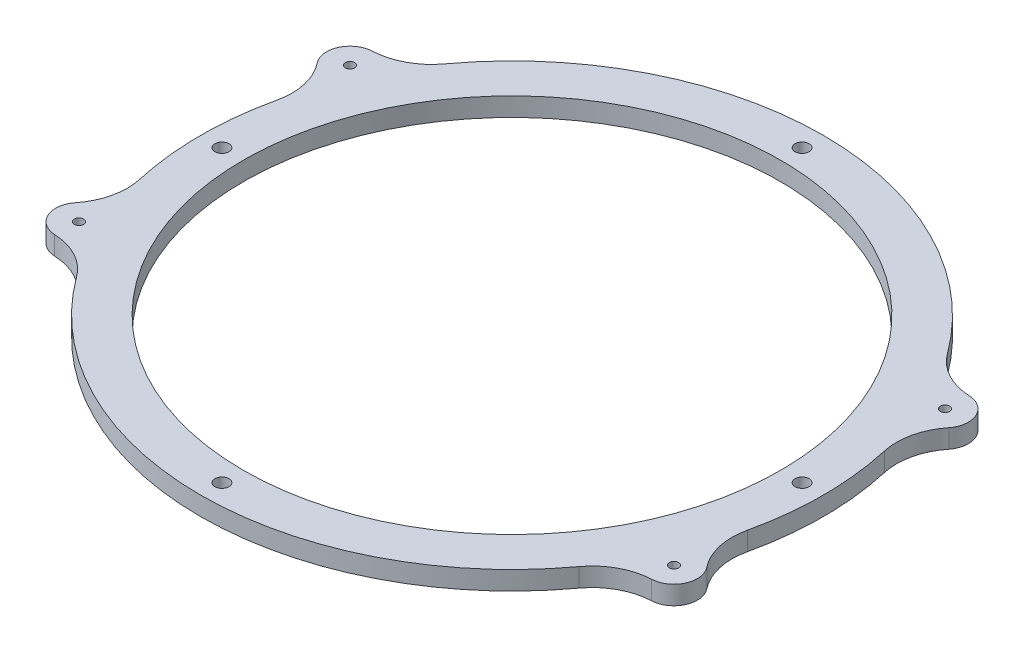
ISO-10303-21;
HEADER;
FILE_DESCRIPTION(('STEP AP214'),'2;1');
FILE_NAME('part.step','',(''),(''),'','','');
FILE_SCHEMA(('AUTOMOTIVE_DESIGN { 1 0 10303 214 1 1 1 1 }'));
ENDSEC;
DATA;
#1=APPLICATION_CONTEXT('core data for automotive mechanical design processes');
#2=APPLICATION_PROTOCOL_DEFINITION('international standard','automotive_design',2000,#1);
#3=PRODUCT_CONTEXT('',#1,'mechanical');
#4=PRODUCT('Part','Part','',(#3));
#5=PRODUCT_RELATED_PRODUCT_CATEGORY('part','',(#4));
#6=PRODUCT_DEFINITION_FORMATION('','',#4);
#7=PRODUCT_DEFINITION_CONTEXT('part definition',#1,'design');
#8=PRODUCT_DEFINITION('design','',#6,#7);
#9=PRODUCT_DEFINITION_SHAPE('','',#8);
#10=(LENGTH_UNIT() NAMED_UNIT(*) SI_UNIT(.MILLI.,.METRE.));
#11=(NAMED_UNIT(*) PLANE_ANGLE_UNIT() SI_UNIT($,.RADIAN.));
#12=(NAMED_UNIT(*) SI_UNIT($,.STERADIAN.) SOLID_ANGLE_UNIT());
#13=UNCERTAINTY_MEASURE_WITH_UNIT(LENGTH_MEASURE(1.E-05),#10,'distance_accuracy_value','');
#14=(GEOMETRIC_REPRESENTATION_CONTEXT(3) GLOBAL_UNCERTAINTY_ASSIGNED_CONTEXT((#13)) GLOBAL_UNIT_ASSIGNED_CONTEXT((#10,
#11,#12)) REPRESENTATION_CONTEXT('',''));
#15=CARTESIAN_POINT('',(0.,0.,0.));
#16=DIRECTION('',(0.,0.,1.));
#17=DIRECTION('',(1.,0.,0.));
#18=AXIS2_PLACEMENT_3D('',#15,#16,#17);
#19=CARTESIAN_POINT('',(0.,6.,0.));
#20=DIRECTION('',(0.,1.,0.));
#21=DIRECTION('',(0.,0.,1.));
#22=AXIS2_PLACEMENT_3D('',#19,#20,#21);
#23=PLANE('',#22);
#24=CARTESIAN_POINT('',(0.,6.,-93.125));
#25=DIRECTION('',(0.,1.,0.));
#26=DIRECTION('',(0.,0.,1.));
#27=AXIS2_PLACEMENT_3D('',#24,#25,#26);
#28=CIRCLE('',#27,2.25);
#29=CARTESIAN_POINT('',(0.,6.,-90.875));
#30=VERTEX_POINT('',#29);
#31=EDGE_CURVE('E288',#30,#30,#28,.T.);
#32=ORIENTED_EDGE('',*,*,#31,.F.);
#33=EDGE_LOOP('',(#32));
#34=FACE_BOUND('',#33,.T.);
#35=CARTESIAN_POINT('',(93.1250000000018,6.,-1.79844989364883E-12));
#36=DIRECTION('',(0.,1.,0.));
#37=DIRECTION('',(0.,0.,1.));
#38=AXIS2_PLACEMENT_3D('',#35,#36,#37);
#39=CIRCLE('',#38,2.25);
#40=CARTESIAN_POINT('',(93.1250000000018,6.,2.2499999999982));
#41=VERTEX_POINT('',#40);
#42=EDGE_CURVE('E298',#41,#41,#39,.T.);
#43=ORIENTED_EDGE('',*,*,#42,.F.);
#44=EDGE_LOOP('',(#43));
#45=FACE_BOUND('',#44,.T.);
#46=CARTESIAN_POINT('',(3.59689978729767E-12,6.,93.125));
#47=DIRECTION('',(0.,1.,0.));
#48=DIRECTION('',(0.,0.,1.));
#49=AXIS2_PLACEMENT_3D('',#46,#47,#48);
#50=CIRCLE('',#49,2.25);
#51=CARTESIAN_POINT('',(3.59689978729767E-12,6.,95.375));
#52=VERTEX_POINT('',#51);
#53=EDGE_CURVE('E304',#52,#52,#50,.T.);
#54=ORIENTED_EDGE('',*,*,#53,.F.);
#55=EDGE_LOOP('',(#54));
#56=FACE_BOUND('',#55,.T.);
#57=CARTESIAN_POINT('',(-93.1249999999982,6.,1.80985441696589E-12));
#58=DIRECTION('',(0.,1.,0.));
#59=DIRECTION('',(0.,0.,1.));
#60=AXIS2_PLACEMENT_3D('',#57,#58,#59);
#61=CIRCLE('',#60,2.25);
#62=CARTESIAN_POINT('',(-93.1249999999982,6.,2.25000000000181));
#63=VERTEX_POINT('',#62);
#64=EDGE_CURVE('E310',#63,#63,#61,.T.);
#65=ORIENTED_EDGE('',*,*,#64,.F.);
#66=EDGE_LOOP('',(#65));
#67=FACE_BOUND('',#66,.T.);
#68=CARTESIAN_POINT('',(-95.5,6.,43.5));
#69=DIRECTION('',(0.,1.,0.));
#70=DIRECTION('',(0.,0.,-1.));
#71=AXIS2_PLACEMENT_3D('',#68,#69,#70);
#72=CIRCLE('',#71,1.5);
#73=CARTESIAN_POINT('',(-95.5,6.,42.));
#74=VERTEX_POINT('',#73);
#75=EDGE_CURVE('E291',#74,#74,#72,.T.);
#76=ORIENTED_EDGE('',*,*,#75,.F.);
#77=EDGE_LOOP('',(#76));
#78=FACE_BOUND('',#77,.T.);
#79=CARTESIAN_POINT('',(95.5,6.,43.5));
#80=DIRECTION('',(0.,1.,0.));
#81=DIRECTION('',(0.,0.,1.));
#82=AXIS2_PLACEMENT_3D('',#79,#80,#81);
#83=CIRCLE('',#82,1.5);
#84=CARTESIAN_POINT('',(95.5,6.,45.));
#85=VERTEX_POINT('',#84);
#86=EDGE_CURVE('E323',#85,#85,#83,.T.);
#87=ORIENTED_EDGE('',*,*,#86,.F.);
#88=EDGE_LOOP('',(#87));
#89=FACE_BOUND('',#88,.T.);
#90=CARTESIAN_POINT('',(95.5,6.,-43.5));
#91=DIRECTION('',(0.,1.,0.));
#92=DIRECTION('',(0.,0.,-1.));
#93=AXIS2_PLACEMENT_3D('',#90,#91,#92);
#94=CIRCLE('',#93,1.5);
#95=CARTESIAN_POINT('',(95.5,6.,-45.));
#96=VERTEX_POINT('',#95);
#97=EDGE_CURVE('E317',#96,#96,#94,.T.);
#98=ORIENTED_EDGE('',*,*,#97,.F.);
#99=EDGE_LOOP('',(#98));
#100=FACE_BOUND('',#99,.T.);
#101=CARTESIAN_POINT('',(-95.5,6.,-43.5));
#102=DIRECTION('',(0.,1.,0.));
#103=DIRECTION('',(0.,0.,1.));
#104=AXIS2_PLACEMENT_3D('',#101,#102,#103);
#105=CIRCLE('',#104,1.5);
#106=CARTESIAN_POINT('',(-95.5,6.,-42.));
#107=VERTEX_POINT('',#106);
#108=EDGE_CURVE('E331',#107,#107,#105,.T.);
#109=ORIENTED_EDGE('',*,*,#108,.F.);
#110=EDGE_LOOP('',(#109));
#111=FACE_BOUND('',#110,.T.);
#112=CARTESIAN_POINT('',(0.,6.,0.));
#113=DIRECTION('',(0.,1.,0.));
#114=DIRECTION('',(0.,0.,1.));
#115=AXIS2_PLACEMENT_3D('',#112,#113,#114);
#116=CIRCLE('',#115,86.25);
#117=CARTESIAN_POINT('',(0.,6.,86.25));
#118=VERTEX_POINT('',#117);
#119=EDGE_CURVE('E175',#118,#118,#116,.T.);
#120=ORIENTED_EDGE('',*,*,#119,.F.);
#121=EDGE_LOOP('',(#120));
#122=FACE_BOUND('',#121,.T.);
#123=CARTESIAN_POINT('',(95.5,6.,-43.5));
#124=DIRECTION('',(0.,-1.,0.));
#125=DIRECTION('',(0.,0.,-1.));
#126=AXIS2_PLACEMENT_3D('',#123,#124,#125);
#127=CIRCLE('',#126,7.5);
#128=CARTESIAN_POINT('',(95.8445152154277,6.,-50.9920831059418));
#129=VERTEX_POINT('',#128);
#130=CARTESIAN_POINT('',(101.378604173696,6.,-38.8425314849157));
#131=VERTEX_POINT('',#130);
#132=EDGE_CURVE('E275',#129,#131,#127,.T.);
#133=ORIENTED_EDGE('',*,*,#132,.F.);
#134=CARTESIAN_POINT('',(96.7632224565683,6.,-70.9709713884533));
#135=DIRECTION('',(0.,1.,0.));
#136=DIRECTION('',(0.,0.,1.));
#137=AXIS2_PLACEMENT_3D('',#134,#135,#136);
#138=CIRCLE('',#137,20.);
#139=CARTESIAN_POINT('',(80.6360187138069,6.,-59.1424761570444));
#140=VERTEX_POINT('',#139);
#141=EDGE_CURVE('E160',#129,#140,#138,.F.);
#142=ORIENTED_EDGE('',*,*,#141,.T.);
#143=CARTESIAN_POINT('',(0.,6.,0.));
#144=DIRECTION('',(0.,1.,0.));
#145=DIRECTION('',(0.,0.,1.));
#146=AXIS2_PLACEMENT_3D('',#143,#144,#145);
#147=CIRCLE('',#146,100.);
#148=CARTESIAN_POINT('',(-80.636018713807,6.,-59.1424761570444));
#149=VERTEX_POINT('',#148);
#150=EDGE_CURVE('E168',#140,#149,#147,.T.);
#151=ORIENTED_EDGE('',*,*,#150,.T.);
#152=CARTESIAN_POINT('',(-96.7632224565684,6.,-70.9709713884533));
#153=DIRECTION('',(0.,1.,0.));
#154=DIRECTION('',(0.,0.,1.));
#155=AXIS2_PLACEMENT_3D('',#152,#153,#154);
#156=CIRCLE('',#155,20.);
#157=CARTESIAN_POINT('',(-95.8445152154278,6.,-50.9920831059418));
#158=VERTEX_POINT('',#157);
#159=EDGE_CURVE('E11',#149,#158,#156,.F.);
#160=ORIENTED_EDGE('',*,*,#159,.T.);
#161=CARTESIAN_POINT('',(-95.5,6.,-43.5));
#162=DIRECTION('',(0.,-1.,0.));
#163=DIRECTION('',(0.,0.,1.));
#164=AXIS2_PLACEMENT_3D('',#161,#162,#163);
#165=CIRCLE('',#164,7.5);
#166=CARTESIAN_POINT('',(-101.378604173696,6.,-38.8425314849157));
#167=VERTEX_POINT('',#166);
#168=EDGE_CURVE('E249',#167,#158,#165,.T.);
#169=ORIENTED_EDGE('',*,*,#168,.F.);
#170=CARTESIAN_POINT('',(-117.054881970219,6.,-26.4226154446909));
#171=DIRECTION('',(0.,1.,0.));
#172=DIRECTION('',(0.,0.,1.));
#173=AXIS2_PLACEMENT_3D('',#170,#171,#172);
#174=CIRCLE('',#173,20.);
#175=CARTESIAN_POINT('',(-97.5457349751828,6.,-22.0188462039091));
#176=VERTEX_POINT('',#175);
#177=EDGE_CURVE('E242',#167,#176,#174,.F.);
#178=ORIENTED_EDGE('',*,*,#177,.T.);
#179=CARTESIAN_POINT('',(0.,6.,0.));
#180=DIRECTION('',(0.,-1.,0.));
#181=DIRECTION('',(0.,0.,1.));
#182=AXIS2_PLACEMENT_3D('',#179,#180,#181);
#183=CIRCLE('',#182,100.);
#184=CARTESIAN_POINT('',(-97.5457349751828,6.,22.018846203909));
#185=VERTEX_POINT('',#184);
#186=EDGE_CURVE('E247',#185,#176,#183,.T.);
#187=ORIENTED_EDGE('',*,*,#186,.F.);
#188=CARTESIAN_POINT('',(-117.054881970219,6.,26.4226154446908));
#189=DIRECTION('',(0.,1.,0.));
#190=DIRECTION('',(0.,0.,1.));
#191=AXIS2_PLACEMENT_3D('',#188,#189,#190);
#192=CIRCLE('',#191,20.);
#193=CARTESIAN_POINT('',(-101.378604173696,6.,38.8425314849157));
#194=VERTEX_POINT('',#193);
#195=EDGE_CURVE('E238',#185,#194,#192,.F.);
#196=ORIENTED_EDGE('',*,*,#195,.T.);
#197=CARTESIAN_POINT('',(-95.5,6.,43.5));
#198=DIRECTION('',(0.,-1.,0.));
#199=DIRECTION('',(0.,0.,-1.));
#200=AXIS2_PLACEMENT_3D('',#197,#198,#199);
#201=CIRCLE('',#200,7.5);
#202=CARTESIAN_POINT('',(-95.8445152154278,6.,50.9920831059418));
#203=VERTEX_POINT('',#202);
#204=EDGE_CURVE('E257',#203,#194,#201,.T.);
#205=ORIENTED_EDGE('',*,*,#204,.F.);
#206=CARTESIAN_POINT('',(-96.7632224565684,6.,70.9709713884534));
#207=DIRECTION('',(0.,1.,0.));
#208=DIRECTION('',(0.,0.,1.));
#209=AXIS2_PLACEMENT_3D('',#206,#207,#208);
#210=CIRCLE('',#209,20.);
#211=CARTESIAN_POINT('',(-80.636018713807,6.,59.1424761570445));
#212=VERTEX_POINT('',#211);
#213=EDGE_CURVE('E234',#203,#212,#210,.F.);
#214=ORIENTED_EDGE('',*,*,#213,.T.);
#215=CARTESIAN_POINT('',(0.,6.,0.));
#216=DIRECTION('',(0.,1.,0.));
#217=DIRECTION('',(0.,0.,1.));
#218=AXIS2_PLACEMENT_3D('',#215,#216,#217);
#219=CIRCLE('',#218,100.);
#220=CARTESIAN_POINT('',(80.636018713807,6.,59.1424761570444));
#221=VERTEX_POINT('',#220);
#222=EDGE_CURVE('E183',#212,#221,#219,.T.);
#223=ORIENTED_EDGE('',*,*,#222,.T.);
#224=CARTESIAN_POINT('',(96.7632224565684,6.,70.9709713884533));
#225=DIRECTION('',(0.,1.,0.));
#226=DIRECTION('',(0.,0.,1.));
#227=AXIS2_PLACEMENT_3D('',#224,#225,#226);
#228=CIRCLE('',#227,20.);
#229=CARTESIAN_POINT('',(95.8445152154277,6.,50.9920831059418));
#230=VERTEX_POINT('',#229);
#231=EDGE_CURVE('E230',#221,#230,#228,.F.);
#232=ORIENTED_EDGE('',*,*,#231,.T.);
#233=CARTESIAN_POINT('',(95.5,6.,43.5));
#234=DIRECTION('',(0.,-1.,0.));
#235=DIRECTION('',(0.,0.,1.));
#236=AXIS2_PLACEMENT_3D('',#233,#234,#235);
#237=CIRCLE('',#236,7.5);
#238=CARTESIAN_POINT('',(101.378604173696,6.,38.8425314849157));
#239=VERTEX_POINT('',#238);
#240=EDGE_CURVE('E280',#239,#230,#237,.T.);
#241=ORIENTED_EDGE('',*,*,#240,.F.);
#242=CARTESIAN_POINT('',(117.054881970219,6.,26.4226154446909));
#243=DIRECTION('',(0.,1.,0.));
#244=DIRECTION('',(0.,0.,1.));
#245=AXIS2_PLACEMENT_3D('',#242,#243,#244);
#246=CIRCLE('',#245,20.);
#247=CARTESIAN_POINT('',(97.5457349751828,6.,22.0188462039091));
#248=VERTEX_POINT('',#247);
#249=EDGE_CURVE('E226',#239,#248,#246,.F.);
#250=ORIENTED_EDGE('',*,*,#249,.T.);
#251=CARTESIAN_POINT('',(0.,6.,0.));
#252=DIRECTION('',(0.,-1.,0.));
#253=DIRECTION('',(0.,0.,-1.));
#254=AXIS2_PLACEMENT_3D('',#251,#252,#253);
#255=CIRCLE('',#254,100.);
#256=CARTESIAN_POINT('',(97.5457349751828,6.,-22.018846203909));
#257=VERTEX_POINT('',#256);
#258=EDGE_CURVE('E283',#257,#248,#255,.T.);
#259=ORIENTED_EDGE('',*,*,#258,.F.);
#260=CARTESIAN_POINT('',(117.054881970219,6.,-26.4226154446908));
#261=DIRECTION('',(0.,1.,0.));
#262=DIRECTION('',(0.,0.,1.));
#263=AXIS2_PLACEMENT_3D('',#260,#261,#262);
#264=CIRCLE('',#263,20.);
#265=EDGE_CURVE('E222',#257,#131,#264,.F.);
#266=ORIENTED_EDGE('',*,*,#265,.T.);
#267=EDGE_LOOP('',(#133,#142,#151,#160,#169,#178,#187,#196,#205,#214,#223,#232,#241,#250,#259,#266));
#268=FACE_BOUND('',#267,.T.);
#269=ADVANCED_FACE('F37',(#34,#45,#56,#67,#78,#89,#100,#111,#122,#268),#23,.T.);
#270=CARTESIAN_POINT('',(0.,0.,0.));
#271=DIRECTION('',(0.,1.,0.));
#272=DIRECTION('',(0.,0.,1.));
#273=AXIS2_PLACEMENT_3D('',#270,#271,#272);
#274=PLANE('',#273);
#275=CARTESIAN_POINT('',(0.,0.,-93.125));
#276=DIRECTION('',(0.,1.,0.));
#277=DIRECTION('',(0.,0.,1.));
#278=AXIS2_PLACEMENT_3D('',#275,#276,#277);
#279=CIRCLE('',#278,2.25);
#280=CARTESIAN_POINT('',(0.,0.,-90.875));
#281=VERTEX_POINT('',#280);
#282=EDGE_CURVE('E292',#281,#281,#279,.T.);
#283=ORIENTED_EDGE('',*,*,#282,.T.);
#284=EDGE_LOOP('',(#283));
#285=FACE_BOUND('',#284,.T.);
#286=CARTESIAN_POINT('',(93.1250000000018,0.,-1.79844989364883E-12));
#287=DIRECTION('',(0.,1.,0.));
#288=DIRECTION('',(0.,0.,1.));
#289=AXIS2_PLACEMENT_3D('',#286,#287,#288);
#290=CIRCLE('',#289,2.25);
#291=CARTESIAN_POINT('',(93.1250000000018,0.,2.2499999999982));
#292=VERTEX_POINT('',#291);
#293=EDGE_CURVE('E295',#292,#292,#290,.T.);
#294=ORIENTED_EDGE('',*,*,#293,.T.);
#295=EDGE_LOOP('',(#294));
#296=FACE_BOUND('',#295,.T.);
#297=CARTESIAN_POINT('',(3.59689978729767E-12,0.,93.125));
#298=DIRECTION('',(0.,1.,0.));
#299=DIRECTION('',(0.,0.,1.));
#300=AXIS2_PLACEMENT_3D('',#297,#298,#299);
#301=CIRCLE('',#300,2.25);
#302=CARTESIAN_POINT('',(3.59689978729767E-12,0.,95.375));
#303=VERTEX_POINT('',#302);
#304=EDGE_CURVE('E301',#303,#303,#301,.T.);
#305=ORIENTED_EDGE('',*,*,#304,.T.);
#306=EDGE_LOOP('',(#305));
#307=FACE_BOUND('',#306,.T.);
#308=CARTESIAN_POINT('',(-93.1249999999982,0.,1.80985441696589E-12));
#309=DIRECTION('',(0.,1.,0.));
#310=DIRECTION('',(0.,0.,1.));
#311=AXIS2_PLACEMENT_3D('',#308,#309,#310);
#312=CIRCLE('',#311,2.25);
#313=CARTESIAN_POINT('',(-93.1249999999982,0.,2.25000000000181));
#314=VERTEX_POINT('',#313);
#315=EDGE_CURVE('E307',#314,#314,#312,.T.);
#316=ORIENTED_EDGE('',*,*,#315,.T.);
#317=EDGE_LOOP('',(#316));
#318=FACE_BOUND('',#317,.T.);
#319=CARTESIAN_POINT('',(-95.5,0.,43.5));
#320=DIRECTION('',(0.,1.,0.));
#321=DIRECTION('',(0.,0.,-1.));
#322=AXIS2_PLACEMENT_3D('',#319,#320,#321);
#323=CIRCLE('',#322,1.5);
#324=CARTESIAN_POINT('',(-95.5,0.,42.));
#325=VERTEX_POINT('',#324);
#326=EDGE_CURVE('E326',#325,#325,#323,.T.);
#327=ORIENTED_EDGE('',*,*,#326,.T.);
#328=EDGE_LOOP('',(#327));
#329=FACE_BOUND('',#328,.T.);
#330=CARTESIAN_POINT('',(95.5,0.,43.5));
#331=DIRECTION('',(0.,1.,0.));
#332=DIRECTION('',(0.,0.,1.));
#333=AXIS2_PLACEMENT_3D('',#330,#331,#332);
#334=CIRCLE('',#333,1.5);
#335=CARTESIAN_POINT('',(95.5,0.,45.));
#336=VERTEX_POINT('',#335);
#337=EDGE_CURVE('E320',#336,#336,#334,.T.);
#338=ORIENTED_EDGE('',*,*,#337,.T.);
#339=EDGE_LOOP('',(#338));
#340=FACE_BOUND('',#339,.T.);
#341=CARTESIAN_POINT('',(95.5,0.,-43.5));
#342=DIRECTION('',(0.,1.,0.));
#343=DIRECTION('',(0.,0.,-1.));
#344=AXIS2_PLACEMENT_3D('',#341,#342,#343);
#345=CIRCLE('',#344,1.5);
#346=CARTESIAN_POINT('',(95.5,0.,-45.));
#347=VERTEX_POINT('',#346);
#348=EDGE_CURVE('E313',#347,#347,#345,.T.);
#349=ORIENTED_EDGE('',*,*,#348,.T.);
#350=EDGE_LOOP('',(#349));
#351=FACE_BOUND('',#350,.T.);
#352=CARTESIAN_POINT('',(-95.5,0.,-43.5));
#353=DIRECTION('',(0.,1.,0.));
#354=DIRECTION('',(0.,0.,1.));
#355=AXIS2_PLACEMENT_3D('',#352,#353,#354);
#356=CIRCLE('',#355,1.5);
#357=CARTESIAN_POINT('',(-95.5,0.,-42.));
#358=VERTEX_POINT('',#357);
#359=EDGE_CURVE('E316',#358,#358,#356,.T.);
#360=ORIENTED_EDGE('',*,*,#359,.T.);
#361=EDGE_LOOP('',(#360));
#362=FACE_BOUND('',#361,.T.);
#363=CARTESIAN_POINT('',(0.,0.,0.));
#364=DIRECTION('',(0.,1.,0.));
#365=DIRECTION('',(0.,0.,1.));
#366=AXIS2_PLACEMENT_3D('',#363,#364,#365);
#367=CIRCLE('',#366,86.25);
#368=CARTESIAN_POINT('',(0.,0.,86.25));
#369=VERTEX_POINT('',#368);
#370=EDGE_CURVE('E180',#369,#369,#367,.T.);
#371=ORIENTED_EDGE('',*,*,#370,.T.);
#372=EDGE_LOOP('',(#371));
#373=FACE_BOUND('',#372,.T.);
#374=CARTESIAN_POINT('',(-95.5,0.,-43.5));
#375=DIRECTION('',(0.,-1.,0.));
#376=DIRECTION('',(0.,0.,1.));
#377=AXIS2_PLACEMENT_3D('',#374,#375,#376);
#378=CIRCLE('',#377,7.5);
#379=CARTESIAN_POINT('',(-101.378604173696,0.,-38.8425314849157));
#380=VERTEX_POINT('',#379);
#381=CARTESIAN_POINT('',(-95.8445152154278,0.,-50.9920831059418));
#382=VERTEX_POINT('',#381);
#383=EDGE_CURVE('E260',#380,#382,#378,.T.);
#384=ORIENTED_EDGE('',*,*,#383,.T.);
#385=CARTESIAN_POINT('',(-96.7632224565684,0.,-70.9709713884533));
#386=DIRECTION('',(0.,1.,0.));
#387=DIRECTION('',(0.,0.,1.));
#388=AXIS2_PLACEMENT_3D('',#385,#386,#387);
#389=CIRCLE('',#388,20.);
#390=CARTESIAN_POINT('',(-80.636018713807,0.,-59.1424761570444));
#391=VERTEX_POINT('',#390);
#392=EDGE_CURVE('E45',#382,#391,#389,.T.);
#393=ORIENTED_EDGE('',*,*,#392,.T.);
#394=CARTESIAN_POINT('',(0.,0.,0.));
#395=DIRECTION('',(0.,1.,0.));
#396=DIRECTION('',(0.,0.,1.));
#397=AXIS2_PLACEMENT_3D('',#394,#395,#396);
#398=CIRCLE('',#397,100.);
#399=CARTESIAN_POINT('',(80.6360187138069,0.,-59.1424761570444));
#400=VERTEX_POINT('',#399);
#401=EDGE_CURVE('E166',#400,#391,#398,.T.);
#402=ORIENTED_EDGE('',*,*,#401,.F.);
#403=CARTESIAN_POINT('',(96.7632224565683,0.,-70.9709713884533));
#404=DIRECTION('',(0.,1.,0.));
#405=DIRECTION('',(0.,0.,1.));
#406=AXIS2_PLACEMENT_3D('',#403,#404,#405);
#407=CIRCLE('',#406,20.);
#408=CARTESIAN_POINT('',(95.8445152154277,0.,-50.9920831059418));
#409=VERTEX_POINT('',#408);
#410=EDGE_CURVE('E150',#400,#409,#407,.T.);
#411=ORIENTED_EDGE('',*,*,#410,.T.);
#412=CARTESIAN_POINT('',(95.5,0.,-43.5));
#413=DIRECTION('',(0.,-1.,0.));
#414=DIRECTION('',(0.,0.,-1.));
#415=AXIS2_PLACEMENT_3D('',#412,#413,#414);
#416=CIRCLE('',#415,7.5);
#417=CARTESIAN_POINT('',(101.378604173696,0.,-38.8425314849157));
#418=VERTEX_POINT('',#417);
#419=EDGE_CURVE('E278',#409,#418,#416,.T.);
#420=ORIENTED_EDGE('',*,*,#419,.T.);
#421=CARTESIAN_POINT('',(117.054881970219,0.,-26.4226154446908));
#422=DIRECTION('',(0.,1.,0.));
#423=DIRECTION('',(0.,0.,1.));
#424=AXIS2_PLACEMENT_3D('',#421,#422,#423);
#425=CIRCLE('',#424,20.);
#426=CARTESIAN_POINT('',(97.5457349751828,0.,-22.018846203909));
#427=VERTEX_POINT('',#426);
#428=EDGE_CURVE('E220',#418,#427,#425,.T.);
#429=ORIENTED_EDGE('',*,*,#428,.T.);
#430=CARTESIAN_POINT('',(0.,0.,0.));
#431=DIRECTION('',(0.,-1.,0.));
#432=DIRECTION('',(0.,0.,-1.));
#433=AXIS2_PLACEMENT_3D('',#430,#431,#432);
#434=CIRCLE('',#433,100.);
#435=CARTESIAN_POINT('',(97.5457349751828,0.,22.0188462039091));
#436=VERTEX_POINT('',#435);
#437=EDGE_CURVE('E274',#427,#436,#434,.T.);
#438=ORIENTED_EDGE('',*,*,#437,.T.);
#439=CARTESIAN_POINT('',(117.054881970219,0.,26.4226154446909));
#440=DIRECTION('',(0.,1.,0.));
#441=DIRECTION('',(0.,0.,1.));
#442=AXIS2_PLACEMENT_3D('',#439,#440,#441);
#443=CIRCLE('',#442,20.);
#444=CARTESIAN_POINT('',(101.378604173696,0.,38.8425314849157));
#445=VERTEX_POINT('',#444);
#446=EDGE_CURVE('E224',#436,#445,#443,.T.);
#447=ORIENTED_EDGE('',*,*,#446,.T.);
#448=CARTESIAN_POINT('',(95.5,0.,43.5));
#449=DIRECTION('',(0.,-1.,0.));
#450=DIRECTION('',(0.,0.,1.));
#451=AXIS2_PLACEMENT_3D('',#448,#449,#450);
#452=CIRCLE('',#451,7.5);
#453=CARTESIAN_POINT('',(95.8445152154277,0.,50.9920831059418));
#454=VERTEX_POINT('',#453);
#455=EDGE_CURVE('E271',#445,#454,#452,.T.);
#456=ORIENTED_EDGE('',*,*,#455,.T.);
#457=CARTESIAN_POINT('',(96.7632224565684,0.,70.9709713884533));
#458=DIRECTION('',(0.,1.,0.));
#459=DIRECTION('',(0.,0.,1.));
#460=AXIS2_PLACEMENT_3D('',#457,#458,#459);
#461=CIRCLE('',#460,20.);
#462=CARTESIAN_POINT('',(80.636018713807,0.,59.1424761570444));
#463=VERTEX_POINT('',#462);
#464=EDGE_CURVE('E228',#454,#463,#461,.T.);
#465=ORIENTED_EDGE('',*,*,#464,.T.);
#466=CARTESIAN_POINT('',(0.,0.,0.));
#467=DIRECTION('',(0.,1.,0.));
#468=DIRECTION('',(0.,0.,1.));
#469=AXIS2_PLACEMENT_3D('',#466,#467,#468);
#470=CIRCLE('',#469,100.);
#471=CARTESIAN_POINT('',(-80.636018713807,0.,59.1424761570445));
#472=VERTEX_POINT('',#471);
#473=EDGE_CURVE('E174',#472,#463,#470,.T.);
#474=ORIENTED_EDGE('',*,*,#473,.F.);
#475=CARTESIAN_POINT('',(-96.7632224565684,0.,70.9709713884534));
#476=DIRECTION('',(0.,1.,0.));
#477=DIRECTION('',(0.,0.,1.));
#478=AXIS2_PLACEMENT_3D('',#475,#476,#477);
#479=CIRCLE('',#478,20.);
#480=CARTESIAN_POINT('',(-95.8445152154278,0.,50.9920831059418));
#481=VERTEX_POINT('',#480);
#482=EDGE_CURVE('E232',#472,#481,#479,.T.);
#483=ORIENTED_EDGE('',*,*,#482,.T.);
#484=CARTESIAN_POINT('',(-95.5,0.,43.5));
#485=DIRECTION('',(0.,-1.,0.));
#486=DIRECTION('',(0.,0.,-1.));
#487=AXIS2_PLACEMENT_3D('',#484,#485,#486);
#488=CIRCLE('',#487,7.5);
#489=CARTESIAN_POINT('',(-101.378604173696,0.,38.8425314849157));
#490=VERTEX_POINT('',#489);
#491=EDGE_CURVE('E267',#481,#490,#488,.T.);
#492=ORIENTED_EDGE('',*,*,#491,.T.);
#493=CARTESIAN_POINT('',(-117.054881970219,0.,26.4226154446908));
#494=DIRECTION('',(0.,1.,0.));
#495=DIRECTION('',(0.,0.,1.));
#496=AXIS2_PLACEMENT_3D('',#493,#494,#495);
#497=CIRCLE('',#496,20.);
#498=CARTESIAN_POINT('',(-97.5457349751828,0.,22.018846203909));
#499=VERTEX_POINT('',#498);
#500=EDGE_CURVE('E236',#490,#499,#497,.T.);
#501=ORIENTED_EDGE('',*,*,#500,.T.);
#502=CARTESIAN_POINT('',(0.,0.,0.));
#503=DIRECTION('',(0.,-1.,0.));
#504=DIRECTION('',(0.,0.,1.));
#505=AXIS2_PLACEMENT_3D('',#502,#503,#504);
#506=CIRCLE('',#505,100.);
#507=CARTESIAN_POINT('',(-97.5457349751828,0.,-22.0188462039091));
#508=VERTEX_POINT('',#507);
#509=EDGE_CURVE('E261',#499,#508,#506,.T.);
#510=ORIENTED_EDGE('',*,*,#509,.T.);
#511=CARTESIAN_POINT('',(-117.054881970219,0.,-26.4226154446909));
#512=DIRECTION('',(0.,1.,0.));
#513=DIRECTION('',(0.,0.,1.));
#514=AXIS2_PLACEMENT_3D('',#511,#512,#513);
#515=CIRCLE('',#514,20.);
#516=EDGE_CURVE('E240',#508,#380,#515,.T.);
#517=ORIENTED_EDGE('',*,*,#516,.T.);
#518=EDGE_LOOP('',(#384,#393,#402,#411,#420,#429,#438,#447,#456,#465,#474,#483,#492,#501,#510,#517));
#519=FACE_BOUND('',#518,.T.);
#520=ADVANCED_FACE('F173',(#285,#296,#307,#318,#329,#340,#351,#362,#373,#519),#274,.F.);
#521=CARTESIAN_POINT('',(0.,6.,0.));
#522=DIRECTION('',(0.,-1.,0.));
#523=DIRECTION('',(0.,0.,-1.));
#524=AXIS2_PLACEMENT_3D('',#521,#522,#523);
#525=CYLINDRICAL_SURFACE('',#524,100.);
#526=ORIENTED_EDGE('',*,*,#150,.F.);
#527=DIRECTION('',(0.,-1.,0.));
#528=VECTOR('',#527,1.);
#529=CARTESIAN_POINT('',(80.6360187138069,6.,-59.1424761570444));
#530=LINE('',#529,#528);
#531=EDGE_CURVE('E154',#140,#400,#530,.T.);
#532=ORIENTED_EDGE('',*,*,#531,.T.);
#533=ORIENTED_EDGE('',*,*,#401,.T.);
#534=DIRECTION('',(0.,-1.,0.));
#535=VECTOR('',#534,1.);
#536=CARTESIAN_POINT('',(-80.636018713807,6.,-59.1424761570444));
#537=LINE('',#536,#535);
#538=EDGE_CURVE('E170',#391,#149,#537,.F.);
#539=ORIENTED_EDGE('',*,*,#538,.T.);
#540=EDGE_LOOP('',(#526,#532,#533,#539));
#541=FACE_BOUND('',#540,.T.);
#542=ADVANCED_FACE('F165',(#541),#525,.T.);
#543=CARTESIAN_POINT('',(0.,6.,0.));
#544=DIRECTION('',(0.,-1.,0.));
#545=DIRECTION('',(0.,0.,-1.));
#546=AXIS2_PLACEMENT_3D('',#543,#544,#545);
#547=CYLINDRICAL_SURFACE('',#546,100.);
#548=ORIENTED_EDGE('',*,*,#473,.T.);
#549=DIRECTION('',(0.,-1.,0.));
#550=VECTOR('',#549,1.);
#551=CARTESIAN_POINT('',(80.6360187138069,6.,59.1424761570444));
#552=LINE('',#551,#550);
#553=EDGE_CURVE('E203',#463,#221,#552,.F.);
#554=ORIENTED_EDGE('',*,*,#553,.T.);
#555=ORIENTED_EDGE('',*,*,#222,.F.);
#556=DIRECTION('',(0.,-1.,0.));
#557=VECTOR('',#556,1.);
#558=CARTESIAN_POINT('',(-80.636018713807,6.,59.1424761570445));
#559=LINE('',#558,#557);
#560=EDGE_CURVE('E200',#212,#472,#559,.T.);
#561=ORIENTED_EDGE('',*,*,#560,.T.);
#562=EDGE_LOOP('',(#548,#554,#555,#561));
#563=FACE_BOUND('',#562,.T.);
#564=ADVANCED_FACE('F395',(#563),#547,.T.);
#565=CARTESIAN_POINT('',(0.,6.,0.));
#566=DIRECTION('',(0.,-1.,0.));
#567=DIRECTION('',(0.,0.,-1.));
#568=AXIS2_PLACEMENT_3D('',#565,#566,#567);
#569=CYLINDRICAL_SURFACE('',#568,86.25);
#570=ORIENTED_EDGE('',*,*,#119,.T.);
#571=EDGE_LOOP('',(#570));
#572=FACE_BOUND('',#571,.T.);
#573=ORIENTED_EDGE('',*,*,#370,.F.);
#574=EDGE_LOOP('',(#573));
#575=FACE_BOUND('',#574,.T.);
#576=ADVANCED_FACE('F392',(#572,#575),#569,.F.);
#577=CARTESIAN_POINT('',(-95.5,6.,-43.5));
#578=DIRECTION('',(0.,-1.,0.));
#579=DIRECTION('',(0.,0.,-1.));
#580=AXIS2_PLACEMENT_3D('',#577,#578,#579);
#581=CYLINDRICAL_SURFACE('',#580,1.5);
#582=ORIENTED_EDGE('',*,*,#108,.T.);
#583=EDGE_LOOP('',(#582));
#584=FACE_BOUND('',#583,.T.);
#585=ORIENTED_EDGE('',*,*,#359,.F.);
#586=EDGE_LOOP('',(#585));
#587=FACE_BOUND('',#586,.T.);
#588=ADVANCED_FACE('F617',(#584,#587),#581,.F.);
#589=CARTESIAN_POINT('',(95.5,6.,-43.5));
#590=DIRECTION('',(0.,-1.,0.));
#591=DIRECTION('',(0.,0.,-1.));
#592=AXIS2_PLACEMENT_3D('',#589,#590,#591);
#593=CYLINDRICAL_SURFACE('',#592,1.5);
#594=ORIENTED_EDGE('',*,*,#97,.T.);
#595=EDGE_LOOP('',(#594));
#596=FACE_BOUND('',#595,.T.);
#597=ORIENTED_EDGE('',*,*,#348,.F.);
#598=EDGE_LOOP('',(#597));
#599=FACE_BOUND('',#598,.T.);
#600=ADVANCED_FACE('F606',(#596,#599),#593,.F.);
#601=CARTESIAN_POINT('',(95.5,6.,43.5));
#602=DIRECTION('',(0.,-1.,0.));
#603=DIRECTION('',(0.,0.,-1.));
#604=AXIS2_PLACEMENT_3D('',#601,#602,#603);
#605=CYLINDRICAL_SURFACE('',#604,1.5);
#606=ORIENTED_EDGE('',*,*,#86,.T.);
#607=EDGE_LOOP('',(#606));
#608=FACE_BOUND('',#607,.T.);
#609=ORIENTED_EDGE('',*,*,#337,.F.);
#610=EDGE_LOOP('',(#609));
#611=FACE_BOUND('',#610,.T.);
#612=ADVANCED_FACE('F595',(#608,#611),#605,.F.);
#613=CARTESIAN_POINT('',(-95.5,6.,43.5));
#614=DIRECTION('',(0.,-1.,0.));
#615=DIRECTION('',(0.,0.,-1.));
#616=AXIS2_PLACEMENT_3D('',#613,#614,#615);
#617=CYLINDRICAL_SURFACE('',#616,1.5);
#618=ORIENTED_EDGE('',*,*,#75,.T.);
#619=EDGE_LOOP('',(#618));
#620=FACE_BOUND('',#619,.T.);
#621=ORIENTED_EDGE('',*,*,#326,.F.);
#622=EDGE_LOOP('',(#621));
#623=FACE_BOUND('',#622,.T.);
#624=ADVANCED_FACE('F584',(#620,#623),#617,.F.);
#625=CARTESIAN_POINT('',(-93.1249999999982,6.,1.80985441696589E-12));
#626=DIRECTION('',(0.,-1.,0.));
#627=DIRECTION('',(0.,0.,-1.));
#628=AXIS2_PLACEMENT_3D('',#625,#626,#627);
#629=CYLINDRICAL_SURFACE('',#628,2.25);
#630=ORIENTED_EDGE('',*,*,#64,.T.);
#631=EDGE_LOOP('',(#630));
#632=FACE_BOUND('',#631,.T.);
#633=ORIENTED_EDGE('',*,*,#315,.F.);
#634=EDGE_LOOP('',(#633));
#635=FACE_BOUND('',#634,.T.);
#636=ADVANCED_FACE('F573',(#632,#635),#629,.F.);
#637=CARTESIAN_POINT('',(3.59689978729767E-12,6.,93.125));
#638=DIRECTION('',(0.,-1.,0.));
#639=DIRECTION('',(0.,0.,-1.));
#640=AXIS2_PLACEMENT_3D('',#637,#638,#639);
#641=CYLINDRICAL_SURFACE('',#640,2.25);
#642=ORIENTED_EDGE('',*,*,#53,.T.);
#643=EDGE_LOOP('',(#642));
#644=FACE_BOUND('',#643,.T.);
#645=ORIENTED_EDGE('',*,*,#304,.F.);
#646=EDGE_LOOP('',(#645));
#647=FACE_BOUND('',#646,.T.);
#648=ADVANCED_FACE('F562',(#644,#647),#641,.F.);
#649=CARTESIAN_POINT('',(93.1250000000018,6.,-1.79844989364883E-12));
#650=DIRECTION('',(0.,-1.,0.));
#651=DIRECTION('',(0.,0.,-1.));
#652=AXIS2_PLACEMENT_3D('',#649,#650,#651);
#653=CYLINDRICAL_SURFACE('',#652,2.25);
#654=ORIENTED_EDGE('',*,*,#42,.T.);
#655=EDGE_LOOP('',(#654));
#656=FACE_BOUND('',#655,.T.);
#657=ORIENTED_EDGE('',*,*,#293,.F.);
#658=EDGE_LOOP('',(#657));
#659=FACE_BOUND('',#658,.T.);
#660=ADVANCED_FACE('F377',(#656,#659),#653,.F.);
#661=CARTESIAN_POINT('',(0.,6.,-93.125));
#662=DIRECTION('',(0.,-1.,0.));
#663=DIRECTION('',(0.,0.,-1.));
#664=AXIS2_PLACEMENT_3D('',#661,#662,#663);
#665=CYLINDRICAL_SURFACE('',#664,2.25);
#666=ORIENTED_EDGE('',*,*,#31,.T.);
#667=EDGE_LOOP('',(#666));
#668=FACE_BOUND('',#667,.T.);
#669=ORIENTED_EDGE('',*,*,#282,.F.);
#670=EDGE_LOOP('',(#669));
#671=FACE_BOUND('',#670,.T.);
#672=ADVANCED_FACE('F370',(#668,#671),#665,.F.);
#673=CARTESIAN_POINT('',(95.5,6.,-43.5));
#674=DIRECTION('',(0.,-1.,0.));
#675=DIRECTION('',(0.,0.,-1.));
#676=AXIS2_PLACEMENT_3D('',#673,#674,#675);
#677=CYLINDRICAL_SURFACE('',#676,7.5);
#678=ORIENTED_EDGE('',*,*,#419,.F.);
#679=DIRECTION('',(0.,-1.,0.));
#680=VECTOR('',#679,1.);
#681=CARTESIAN_POINT('',(95.8445152154277,6.,-50.9920831059418));
#682=LINE('',#681,#680);
#683=EDGE_CURVE('E155',#409,#129,#682,.F.);
#684=ORIENTED_EDGE('',*,*,#683,.T.);
#685=ORIENTED_EDGE('',*,*,#132,.T.);
#686=DIRECTION('',(0.,-1.,0.));
#687=VECTOR('',#686,1.);
#688=CARTESIAN_POINT('',(101.378604173696,6.,-38.8425314849157));
#689=LINE('',#688,#687);
#690=EDGE_CURVE('E169',#131,#418,#689,.T.);
#691=ORIENTED_EDGE('',*,*,#690,.T.);
#692=EDGE_LOOP('',(#678,#684,#685,#691));
#693=FACE_BOUND('',#692,.T.);
#694=ADVANCED_FACE('F368',(#693),#677,.T.);
#695=CARTESIAN_POINT('',(0.,6.,0.));
#696=DIRECTION('',(0.,-1.,0.));
#697=DIRECTION('',(0.,0.,-1.));
#698=AXIS2_PLACEMENT_3D('',#695,#696,#697);
#699=CYLINDRICAL_SURFACE('',#698,100.);
#700=ORIENTED_EDGE('',*,*,#437,.F.);
#701=DIRECTION('',(0.,-1.,0.));
#702=VECTOR('',#701,1.);
#703=CARTESIAN_POINT('',(97.5457349751829,6.,-22.018846203909));
#704=LINE('',#703,#702);
#705=EDGE_CURVE('E193',#427,#257,#704,.F.);
#706=ORIENTED_EDGE('',*,*,#705,.T.);
#707=ORIENTED_EDGE('',*,*,#258,.T.);
#708=DIRECTION('',(0.,-1.,0.));
#709=VECTOR('',#708,1.);
#710=CARTESIAN_POINT('',(97.5457349751828,6.,22.0188462039091));
#711=LINE('',#710,#709);
#712=EDGE_CURVE('E190',#248,#436,#711,.T.);
#713=ORIENTED_EDGE('',*,*,#712,.T.);
#714=EDGE_LOOP('',(#700,#706,#707,#713));
#715=FACE_BOUND('',#714,.T.);
#716=ADVANCED_FACE('F360',(#715),#699,.T.);
#717=CARTESIAN_POINT('',(95.5,6.,43.5));
#718=DIRECTION('',(0.,-1.,0.));
#719=DIRECTION('',(0.,0.,-1.));
#720=AXIS2_PLACEMENT_3D('',#717,#718,#719);
#721=CYLINDRICAL_SURFACE('',#720,7.5);
#722=ORIENTED_EDGE('',*,*,#455,.F.);
#723=DIRECTION('',(0.,-1.,0.));
#724=VECTOR('',#723,1.);
#725=CARTESIAN_POINT('',(101.378604173696,6.,38.8425314849157));
#726=LINE('',#725,#724);
#727=EDGE_CURVE('E198',#445,#239,#726,.F.);
#728=ORIENTED_EDGE('',*,*,#727,.T.);
#729=ORIENTED_EDGE('',*,*,#240,.T.);
#730=DIRECTION('',(0.,-1.,0.));
#731=VECTOR('',#730,1.);
#732=CARTESIAN_POINT('',(95.8445152154277,6.,50.9920831059418));
#733=LINE('',#732,#731);
#734=EDGE_CURVE('E195',#230,#454,#733,.T.);
#735=ORIENTED_EDGE('',*,*,#734,.T.);
#736=EDGE_LOOP('',(#722,#728,#729,#735));
#737=FACE_BOUND('',#736,.T.);
#738=ADVANCED_FACE('F351',(#737),#721,.T.);
#739=CARTESIAN_POINT('',(-95.5,6.,43.5));
#740=DIRECTION('',(0.,-1.,0.));
#741=DIRECTION('',(0.,0.,-1.));
#742=AXIS2_PLACEMENT_3D('',#739,#740,#741);
#743=CYLINDRICAL_SURFACE('',#742,7.5);
#744=ORIENTED_EDGE('',*,*,#491,.F.);
#745=DIRECTION('',(0.,-1.,0.));
#746=VECTOR('',#745,1.);
#747=CARTESIAN_POINT('',(-95.8445152154278,6.,50.9920831059418));
#748=LINE('',#747,#746);
#749=EDGE_CURVE('E208',#481,#203,#748,.F.);
#750=ORIENTED_EDGE('',*,*,#749,.T.);
#751=ORIENTED_EDGE('',*,*,#204,.T.);
#752=DIRECTION('',(0.,-1.,0.));
#753=VECTOR('',#752,1.);
#754=CARTESIAN_POINT('',(-101.378604173696,6.,38.8425314849157));
#755=LINE('',#754,#753);
#756=EDGE_CURVE('E205',#194,#490,#755,.T.);
#757=ORIENTED_EDGE('',*,*,#756,.T.);
#758=EDGE_LOOP('',(#744,#750,#751,#757));
#759=FACE_BOUND('',#758,.T.);
#760=ADVANCED_FACE('F488',(#759),#743,.T.);
#761=CARTESIAN_POINT('',(0.,6.,0.));
#762=DIRECTION('',(0.,-1.,0.));
#763=DIRECTION('',(0.,0.,-1.));
#764=AXIS2_PLACEMENT_3D('',#761,#762,#763);
#765=CYLINDRICAL_SURFACE('',#764,100.);
#766=ORIENTED_EDGE('',*,*,#509,.F.);
#767=DIRECTION('',(0.,-1.,0.));
#768=VECTOR('',#767,1.);
#769=CARTESIAN_POINT('',(-97.5457349751829,6.,22.018846203909));
#770=LINE('',#769,#768);
#771=EDGE_CURVE('E213',#499,#185,#770,.F.);
#772=ORIENTED_EDGE('',*,*,#771,.T.);
#773=ORIENTED_EDGE('',*,*,#186,.T.);
#774=DIRECTION('',(0.,-1.,0.));
#775=VECTOR('',#774,1.);
#776=CARTESIAN_POINT('',(-97.5457349751828,6.,-22.0188462039091));
#777=LINE('',#776,#775);
#778=EDGE_CURVE('E210',#176,#508,#777,.T.);
#779=ORIENTED_EDGE('',*,*,#778,.T.);
#780=EDGE_LOOP('',(#766,#772,#773,#779));
#781=FACE_BOUND('',#780,.T.);
#782=ADVANCED_FACE('F254',(#781),#765,.T.);
#783=CARTESIAN_POINT('',(-95.5,6.,-43.5));
#784=DIRECTION('',(0.,-1.,0.));
#785=DIRECTION('',(0.,0.,-1.));
#786=AXIS2_PLACEMENT_3D('',#783,#784,#785);
#787=CYLINDRICAL_SURFACE('',#786,7.5);
#788=ORIENTED_EDGE('',*,*,#383,.F.);
#789=DIRECTION('',(0.,-1.,0.));
#790=VECTOR('',#789,1.);
#791=CARTESIAN_POINT('',(-101.378604173696,6.,-38.8425314849157));
#792=LINE('',#791,#790);
#793=EDGE_CURVE('E57',#380,#167,#792,.F.);
#794=ORIENTED_EDGE('',*,*,#793,.T.);
#795=ORIENTED_EDGE('',*,*,#168,.T.);
#796=DIRECTION('',(0.,-1.,0.));
#797=VECTOR('',#796,1.);
#798=CARTESIAN_POINT('',(-95.8445152154278,6.,-50.9920831059418));
#799=LINE('',#798,#797);
#800=EDGE_CURVE('E215',#158,#382,#799,.T.);
#801=ORIENTED_EDGE('',*,*,#800,.T.);
#802=EDGE_LOOP('',(#788,#794,#795,#801));
#803=FACE_BOUND('',#802,.T.);
#804=ADVANCED_FACE('F262',(#803),#787,.T.);
#805=CARTESIAN_POINT('',(96.7632224565683,6.,-70.9709713884533));
#806=DIRECTION('',(0.,1.,0.));
#807=DIRECTION('',(0.,0.,1.));
#808=AXIS2_PLACEMENT_3D('',#805,#806,#807);
#809=CYLINDRICAL_SURFACE('',#808,20.);
#810=ORIENTED_EDGE('',*,*,#141,.F.);
#811=ORIENTED_EDGE('',*,*,#683,.F.);
#812=ORIENTED_EDGE('',*,*,#410,.F.);
#813=ORIENTED_EDGE('',*,*,#531,.F.);
#814=EDGE_LOOP('',(#810,#811,#812,#813));
#815=FACE_BOUND('',#814,.T.);
#816=ADVANCED_FACE('F153',(#815),#809,.F.);
#817=CARTESIAN_POINT('',(117.054881970219,6.,-26.4226154446908));
#818=DIRECTION('',(0.,1.,0.));
#819=DIRECTION('',(0.,0.,1.));
#820=AXIS2_PLACEMENT_3D('',#817,#818,#819);
#821=CYLINDRICAL_SURFACE('',#820,20.);
#822=ORIENTED_EDGE('',*,*,#265,.F.);
#823=ORIENTED_EDGE('',*,*,#705,.F.);
#824=ORIENTED_EDGE('',*,*,#428,.F.);
#825=ORIENTED_EDGE('',*,*,#690,.F.);
#826=EDGE_LOOP('',(#822,#823,#824,#825));
#827=FACE_BOUND('',#826,.T.);
#828=ADVANCED_FACE('F366',(#827),#821,.F.);
#829=CARTESIAN_POINT('',(117.054881970219,6.,26.4226154446909));
#830=DIRECTION('',(0.,1.,0.));
#831=DIRECTION('',(0.,0.,1.));
#832=AXIS2_PLACEMENT_3D('',#829,#830,#831);
#833=CYLINDRICAL_SURFACE('',#832,20.);
#834=ORIENTED_EDGE('',*,*,#249,.F.);
#835=ORIENTED_EDGE('',*,*,#727,.F.);
#836=ORIENTED_EDGE('',*,*,#446,.F.);
#837=ORIENTED_EDGE('',*,*,#712,.F.);
#838=EDGE_LOOP('',(#834,#835,#836,#837));
#839=FACE_BOUND('',#838,.T.);
#840=ADVANCED_FACE('F358',(#839),#833,.F.);
#841=CARTESIAN_POINT('',(96.7632224565684,6.,70.9709713884533));
#842=DIRECTION('',(0.,1.,0.));
#843=DIRECTION('',(0.,0.,1.));
#844=AXIS2_PLACEMENT_3D('',#841,#842,#843);
#845=CYLINDRICAL_SURFACE('',#844,20.);
#846=ORIENTED_EDGE('',*,*,#231,.F.);
#847=ORIENTED_EDGE('',*,*,#553,.F.);
#848=ORIENTED_EDGE('',*,*,#464,.F.);
#849=ORIENTED_EDGE('',*,*,#734,.F.);
#850=EDGE_LOOP('',(#846,#847,#848,#849));
#851=FACE_BOUND('',#850,.T.);
#852=ADVANCED_FACE('F348',(#851),#845,.F.);
#853=CARTESIAN_POINT('',(-96.7632224565684,6.,70.9709713884534));
#854=DIRECTION('',(0.,1.,0.));
#855=DIRECTION('',(0.,0.,1.));
#856=AXIS2_PLACEMENT_3D('',#853,#854,#855);
#857=CYLINDRICAL_SURFACE('',#856,20.);
#858=ORIENTED_EDGE('',*,*,#213,.F.);
#859=ORIENTED_EDGE('',*,*,#749,.F.);
#860=ORIENTED_EDGE('',*,*,#482,.F.);
#861=ORIENTED_EDGE('',*,*,#560,.F.);
#862=EDGE_LOOP('',(#858,#859,#860,#861));
#863=FACE_BOUND('',#862,.T.);
#864=ADVANCED_FACE('F408',(#863),#857,.F.);
#865=CARTESIAN_POINT('',(-117.054881970219,6.,26.4226154446908));
#866=DIRECTION('',(0.,1.,0.));
#867=DIRECTION('',(0.,0.,1.));
#868=AXIS2_PLACEMENT_3D('',#865,#866,#867);
#869=CYLINDRICAL_SURFACE('',#868,20.);
#870=ORIENTED_EDGE('',*,*,#195,.F.);
#871=ORIENTED_EDGE('',*,*,#771,.F.);
#872=ORIENTED_EDGE('',*,*,#500,.F.);
#873=ORIENTED_EDGE('',*,*,#756,.F.);
#874=EDGE_LOOP('',(#870,#871,#872,#873));
#875=FACE_BOUND('',#874,.T.);
#876=ADVANCED_FACE('F411',(#875),#869,.F.);
#877=CARTESIAN_POINT('',(-117.054881970219,6.,-26.4226154446909));
#878=DIRECTION('',(0.,1.,0.));
#879=DIRECTION('',(0.,0.,1.));
#880=AXIS2_PLACEMENT_3D('',#877,#878,#879);
#881=CYLINDRICAL_SURFACE('',#880,20.);
#882=ORIENTED_EDGE('',*,*,#177,.F.);
#883=ORIENTED_EDGE('',*,*,#793,.F.);
#884=ORIENTED_EDGE('',*,*,#516,.F.);
#885=ORIENTED_EDGE('',*,*,#778,.F.);
#886=EDGE_LOOP('',(#882,#883,#884,#885));
#887=FACE_BOUND('',#886,.T.);
#888=ADVANCED_FACE('F259',(#887),#881,.F.);
#889=CARTESIAN_POINT('',(-96.7632224565684,6.,-70.9709713884533));
#890=DIRECTION('',(0.,1.,0.));
#891=DIRECTION('',(0.,0.,1.));
#892=AXIS2_PLACEMENT_3D('',#889,#890,#891);
#893=CYLINDRICAL_SURFACE('',#892,20.);
#894=ORIENTED_EDGE('',*,*,#159,.F.);
#895=ORIENTED_EDGE('',*,*,#538,.F.);
#896=ORIENTED_EDGE('',*,*,#392,.F.);
#897=ORIENTED_EDGE('',*,*,#800,.F.);
#898=EDGE_LOOP('',(#894,#895,#896,#897));
#899=FACE_BOUND('',#898,.T.);
#900=ADVANCED_FACE('F39',(#899),#893,.F.);
#901=CLOSED_SHELL('',(#269,#520,#542,#564,#576,#588,#600,#612,#624,#636,#648,#660,#672,#694,
#716,#738,#760,#782,#804,#816,#828,#840,#852,#864,#876,#888,#900));
#902=MANIFOLD_SOLID_BREP('B2',#901);
#903=ADVANCED_BREP_SHAPE_REPRESENTATION('',(#18,#902),#14);
#904=SHAPE_DEFINITION_REPRESENTATION(#9,#903);
ENDSEC;
END-ISO-10303-21;
